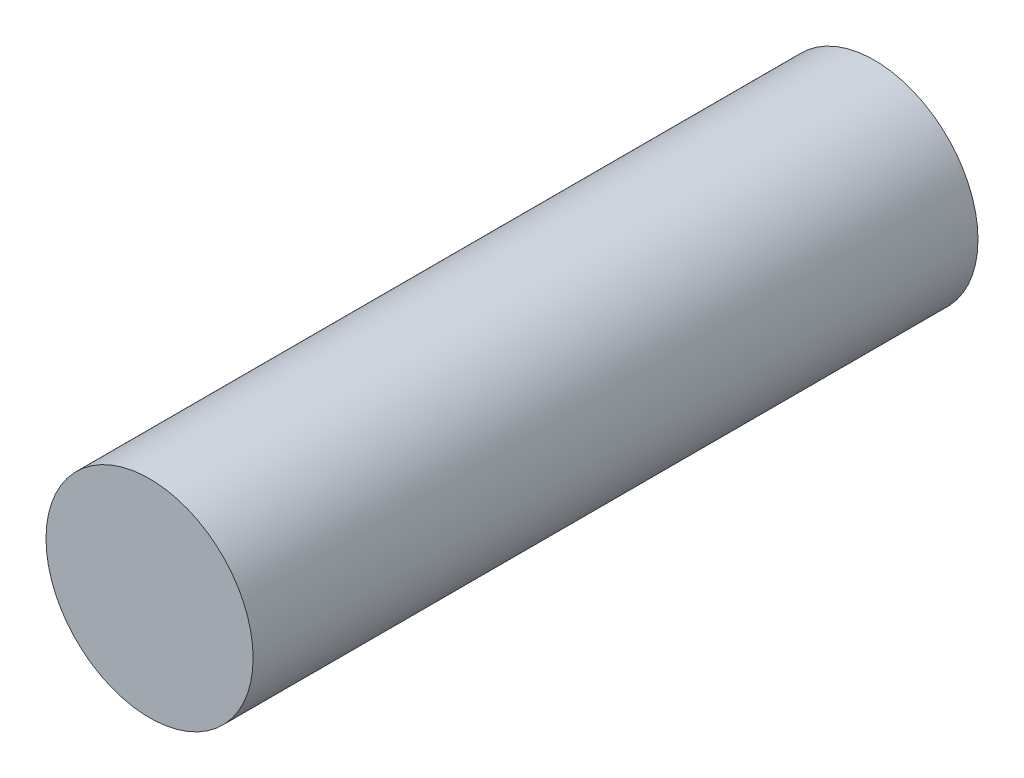
ISO-10303-21;
HEADER;
FILE_DESCRIPTION(('STEP AP214'),'2;1');
FILE_NAME('part.step','',(''),(''),'','','');
FILE_SCHEMA(('AUTOMOTIVE_DESIGN { 1 0 10303 214 1 1 1 1 }'));
ENDSEC;
DATA;
#1=APPLICATION_CONTEXT('core data for automotive mechanical design processes');
#2=APPLICATION_PROTOCOL_DEFINITION('international standard','automotive_design',2000,#1);
#3=PRODUCT_CONTEXT('',#1,'mechanical');
#4=PRODUCT('Part','Part','',(#3));
#5=PRODUCT_RELATED_PRODUCT_CATEGORY('part','',(#4));
#6=PRODUCT_DEFINITION_FORMATION('','',#4);
#7=PRODUCT_DEFINITION_CONTEXT('part definition',#1,'design');
#8=PRODUCT_DEFINITION('design','',#6,#7);
#9=PRODUCT_DEFINITION_SHAPE('','',#8);
#10=(LENGTH_UNIT() NAMED_UNIT(*) SI_UNIT(.MILLI.,.METRE.));
#11=(NAMED_UNIT(*) PLANE_ANGLE_UNIT() SI_UNIT($,.RADIAN.));
#12=(NAMED_UNIT(*) SI_UNIT($,.STERADIAN.) SOLID_ANGLE_UNIT());
#13=UNCERTAINTY_MEASURE_WITH_UNIT(LENGTH_MEASURE(1.E-05),#10,'distance_accuracy_value','');
#14=(GEOMETRIC_REPRESENTATION_CONTEXT(3) GLOBAL_UNCERTAINTY_ASSIGNED_CONTEXT((#13)) GLOBAL_UNIT_ASSIGNED_CONTEXT((#10,
#11,#12)) REPRESENTATION_CONTEXT('',''));
#15=CARTESIAN_POINT('',(0.,0.,0.));
#16=DIRECTION('',(0.,0.,1.));
#17=DIRECTION('',(1.,0.,0.));
#18=AXIS2_PLACEMENT_3D('',#15,#16,#17);
#19=CARTESIAN_POINT('',(-383.125,-140.161341077563,-28.));
#20=DIRECTION('',(0.,0.,1.));
#21=DIRECTION('',(1.,0.,0.));
#22=AXIS2_PLACEMENT_3D('',#19,#20,#21);
#23=CYLINDRICAL_SURFACE('',#22,3.99999999999999);
#24=CARTESIAN_POINT('',(-383.125,-140.161341077563,-28.));
#25=DIRECTION('',(0.,0.,1.));
#26=DIRECTION('',(1.,0.,0.));
#27=AXIS2_PLACEMENT_3D('',#24,#25,#26);
#28=CIRCLE('',#27,3.99999999999999);
#29=CARTESIAN_POINT('',(-379.125,-140.161341077563,-28.));
#30=VERTEX_POINT('',#29);
#31=EDGE_CURVE('E10',#30,#30,#28,.T.);
#32=ORIENTED_EDGE('',*,*,#31,.T.);
#33=EDGE_LOOP('',(#32));
#34=FACE_BOUND('',#33,.T.);
#35=CARTESIAN_POINT('',(-383.125,-140.161341077563,0.));
#36=DIRECTION('',(0.,0.,1.));
#37=DIRECTION('',(1.,0.,0.));
#38=AXIS2_PLACEMENT_3D('',#35,#36,#37);
#39=CIRCLE('',#38,3.99999999999999);
#40=CARTESIAN_POINT('',(-379.125,-140.161341077563,0.));
#41=VERTEX_POINT('',#40);
#42=EDGE_CURVE('E33',#41,#41,#39,.T.);
#43=ORIENTED_EDGE('',*,*,#42,.F.);
#44=EDGE_LOOP('',(#43));
#45=FACE_BOUND('',#44,.T.);
#46=ADVANCED_FACE('F30',(#34,#45),#23,.T.);
#47=CARTESIAN_POINT('',(-383.125,-140.161341077563,-28.));
#48=DIRECTION('',(0.,0.,1.));
#49=DIRECTION('',(1.,0.,0.));
#50=AXIS2_PLACEMENT_3D('',#47,#48,#49);
#51=PLANE('',#50);
#52=ORIENTED_EDGE('',*,*,#31,.F.);
#53=EDGE_LOOP('',(#52));
#54=FACE_BOUND('',#53,.T.);
#55=ADVANCED_FACE('F45',(#54),#51,.F.);
#56=CARTESIAN_POINT('',(-383.125,-140.161341077563,0.));
#57=DIRECTION('',(0.,0.,1.));
#58=DIRECTION('',(1.,0.,0.));
#59=AXIS2_PLACEMENT_3D('',#56,#57,#58);
#60=PLANE('',#59);
#61=ORIENTED_EDGE('',*,*,#42,.T.);
#62=EDGE_LOOP('',(#61));
#63=FACE_BOUND('',#62,.T.);
#64=ADVANCED_FACE('F42',(#63),#60,.T.);
#65=CLOSED_SHELL('',(#46,#55,#64));
#66=MANIFOLD_SOLID_BREP('B2',#65);
#67=ADVANCED_BREP_SHAPE_REPRESENTATION('',(#18,#66),#14);
#68=SHAPE_DEFINITION_REPRESENTATION(#9,#67);
ENDSEC;
END-ISO-10303-21;
